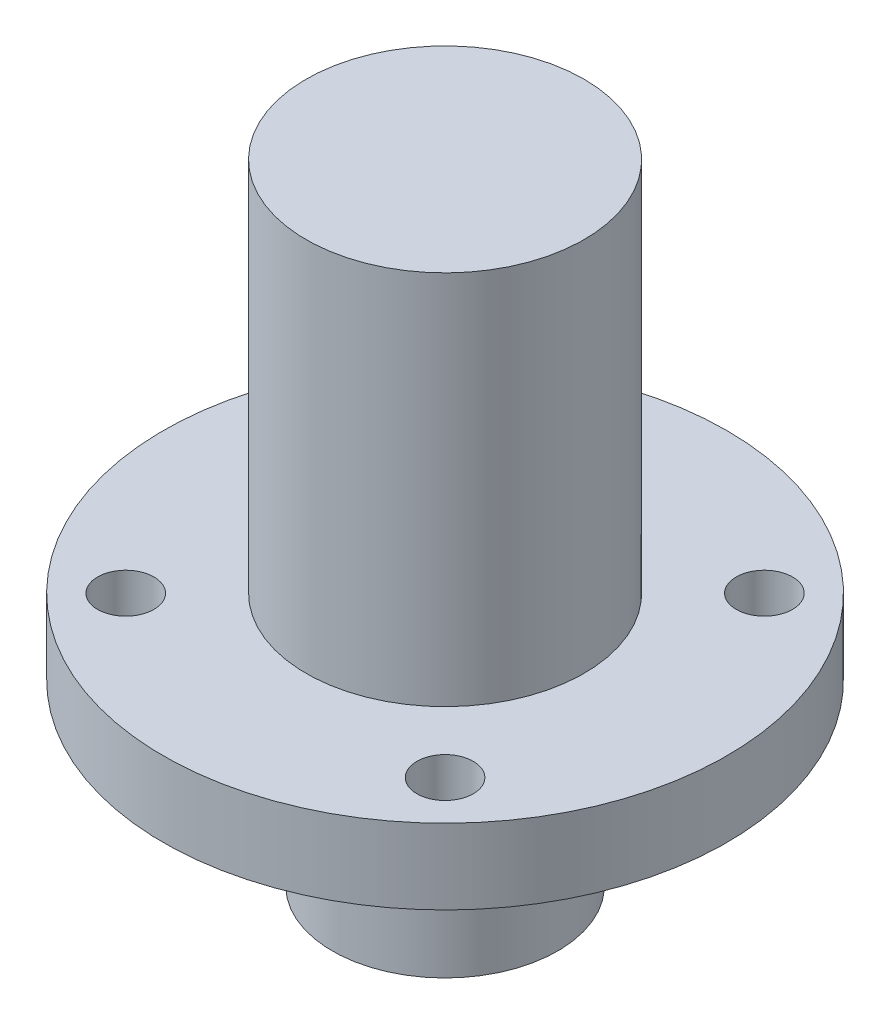
ISO-10303-21;
HEADER;
FILE_DESCRIPTION(('STEP AP214'),'2;1');
FILE_NAME('part.step','',(''),(''),'','','');
FILE_SCHEMA(('AUTOMOTIVE_DESIGN { 1 0 10303 214 1 1 1 1 }'));
ENDSEC;
DATA;
#1=APPLICATION_CONTEXT('core data for automotive mechanical design processes');
#2=APPLICATION_PROTOCOL_DEFINITION('international standard','automotive_design',2000,#1);
#3=PRODUCT_CONTEXT('',#1,'mechanical');
#4=PRODUCT('Part','Part','',(#3));
#5=PRODUCT_RELATED_PRODUCT_CATEGORY('part','',(#4));
#6=PRODUCT_DEFINITION_FORMATION('','',#4);
#7=PRODUCT_DEFINITION_CONTEXT('part definition',#1,'design');
#8=PRODUCT_DEFINITION('design','',#6,#7);
#9=PRODUCT_DEFINITION_SHAPE('','',#8);
#10=(LENGTH_UNIT() NAMED_UNIT(*) SI_UNIT(.MILLI.,.METRE.));
#11=(NAMED_UNIT(*) PLANE_ANGLE_UNIT() SI_UNIT($,.RADIAN.));
#12=(NAMED_UNIT(*) SI_UNIT($,.STERADIAN.) SOLID_ANGLE_UNIT());
#13=UNCERTAINTY_MEASURE_WITH_UNIT(LENGTH_MEASURE(1.E-05),#10,'distance_accuracy_value','');
#14=(GEOMETRIC_REPRESENTATION_CONTEXT(3) GLOBAL_UNCERTAINTY_ASSIGNED_CONTEXT((#13)) GLOBAL_UNIT_ASSIGNED_CONTEXT((#10,
#11,#12)) REPRESENTATION_CONTEXT('',''));
#15=CARTESIAN_POINT('',(0.,0.,0.));
#16=DIRECTION('',(0.,0.,1.));
#17=DIRECTION('',(1.,0.,0.));
#18=AXIS2_PLACEMENT_3D('',#15,#16,#17);
#19=CARTESIAN_POINT('',(0.,0.,0.));
#20=DIRECTION('',(0.,1.,0.));
#21=DIRECTION('',(0.,0.,1.));
#22=AXIS2_PLACEMENT_3D('',#19,#20,#21);
#23=PLANE('',#22);
#24=CARTESIAN_POINT('',(0.,0.,0.));
#25=DIRECTION('',(0.,1.,0.));
#26=DIRECTION('',(0.,0.,1.));
#27=AXIS2_PLACEMENT_3D('',#24,#25,#26);
#28=CIRCLE('',#27,3.);
#29=CARTESIAN_POINT('',(0.,0.,3.));
#30=VERTEX_POINT('',#29);
#31=EDGE_CURVE('E18',#30,#30,#28,.F.);
#32=ORIENTED_EDGE('',*,*,#31,.T.);
#33=EDGE_LOOP('',(#32));
#34=FACE_BOUND('',#33,.T.);
#35=ADVANCED_FACE('F15',(#34),#23,.F.);
#36=CARTESIAN_POINT('',(0.,-13.5,0.));
#37=DIRECTION('',(0.,1.,0.));
#38=DIRECTION('',(0.,0.,1.));
#39=AXIS2_PLACEMENT_3D('',#36,#37,#38);
#40=CYLINDRICAL_SURFACE('',#39,3.);
#41=CARTESIAN_POINT('',(0.,-13.5,0.));
#42=DIRECTION('',(0.,1.,0.));
#43=DIRECTION('',(0.,0.,1.));
#44=AXIS2_PLACEMENT_3D('',#41,#42,#43);
#45=CIRCLE('',#44,3.);
#46=CARTESIAN_POINT('',(0.,-13.5,3.00000000000001));
#47=VERTEX_POINT('',#46);
#48=EDGE_CURVE('E231',#47,#47,#45,.F.);
#49=ORIENTED_EDGE('',*,*,#48,.T.);
#50=EDGE_LOOP('',(#49));
#51=FACE_BOUND('',#50,.T.);
#52=ORIENTED_EDGE('',*,*,#31,.F.);
#53=EDGE_LOOP('',(#52));
#54=FACE_BOUND('',#53,.T.);
#55=CARTESIAN_POINT('',(0.,-7.875,3.00000000000001));
#56=CARTESIAN_POINT('',(-0.0557681985187935,-7.87500315639322,2.99999771774198));
#57=CARTESIAN_POINT('',(-0.111592826024643,-7.87957270352456,2.99842813446581));
#58=CARTESIAN_POINT('',(-0.221651603388951,-7.89769444796325,2.9923103999241));
#59=CARTESIAN_POINT('',(-0.275882995246631,-7.91126136185447,2.98775736891462));
#60=CARTESIAN_POINT('',(-0.381064108690752,-7.94685282185869,2.97616923326795));
#61=CARTESIAN_POINT('',(-0.432021235043022,-7.9688574391952,2.96913998030726));
#62=CARTESIAN_POINT('',(-0.529502310394442,-8.02062537747109,2.95331495585036));
#63=CARTESIAN_POINT('',(-0.576026738263901,-8.05038785901734,2.94451937549263));
#64=CARTESIAN_POINT('',(-0.665032275740394,-8.11796397160462,2.92572548917806));
#65=CARTESIAN_POINT('',(-0.707331121420944,-8.15600930824795,2.91569723263784));
#66=CARTESIAN_POINT('',(-0.785090323506352,-8.23858034903304,2.89572929041068));
#67=CARTESIAN_POINT('',(-0.820548717152932,-8.28310790673287,2.88578963092323));
#68=CARTESIAN_POINT('',(-0.884675707013827,-8.3790377221472,2.86679334128091));
#69=CARTESIAN_POINT('',(-0.913104598672638,-8.43060806474581,2.85777282843763));
#70=CARTESIAN_POINT('',(-0.960807381799251,-8.53815557218786,2.842091546309));
#71=CARTESIAN_POINT('',(-0.980084266063646,-8.5941312894404,2.83543000579777));
#72=CARTESIAN_POINT('',(-1.00824803630976,-8.70683062889315,2.82553588146698));
#73=CARTESIAN_POINT('',(-1.01747641885596,-8.76345874846577,2.82219096584632));
#74=CARTESIAN_POINT('',(-1.02634892814108,-8.87755083519966,2.81897717112307));
#75=CARTESIAN_POINT('',(-1.02599619712845,-8.93501452214662,2.81910715238348));
#76=CARTESIAN_POINT('',(-1.01598088679388,-9.04619530743339,2.8227303144107));
#77=CARTESIAN_POINT('',(-1.00676909065796,-9.09995925258925,2.82606064296596));
#78=CARTESIAN_POINT('',(-0.980034319750464,-9.20512708523259,2.83544200336763));
#79=CARTESIAN_POINT('',(-0.962510265290577,-9.25653066517802,2.84149338864977));
#80=CARTESIAN_POINT('',(-0.91936227021981,-9.35652321249325,2.85574768071261));
#81=CARTESIAN_POINT('',(-0.89360783894118,-9.40505077363136,2.86398485872874));
#82=CARTESIAN_POINT('',(-0.834822148521471,-9.49723311869947,2.8816682615302));
#83=CARTESIAN_POINT('',(-0.801789081052106,-9.54088668765085,2.89111478652488));
#84=CARTESIAN_POINT('',(-0.727244000371622,-9.62460470054454,2.91078677867293));
#85=CARTESIAN_POINT('',(-0.68536614306611,-9.6643406812821,2.92102654251258));
#86=CARTESIAN_POINT('',(-0.595399732886536,-9.73632754507554,2.94068300072235));
#87=CARTESIAN_POINT('',(-0.547308452374756,-9.7685751232936,2.95009933054987));
#88=CARTESIAN_POINT('',(-0.445542723212908,-9.82495408056372,2.96718441032709));
#89=CARTESIAN_POINT('',(-0.391810123570138,-9.84898725527921,2.97483168401103));
#90=CARTESIAN_POINT('',(-0.280797281645058,-9.88753006308091,2.98734907044193));
#91=CARTESIAN_POINT('',(-0.223524548981399,-9.90205914629182,2.99222485234876));
#92=CARTESIAN_POINT('',(-0.138097332351485,-9.91603312806549,2.99694583737048));
#93=CARTESIAN_POINT('',(-0.110602454311793,-9.91939138097834,2.99808762097649));
#94=CARTESIAN_POINT('',(-0.0554096955060137,-9.92387560258352,2.99961526980968));
#95=CARTESIAN_POINT('',(-0.027711814482597,-9.92500156844565,3.00000113407847));
#96=CARTESIAN_POINT('',(0.055768198518768,-9.92499684360696,2.99999771774204));
#97=CARTESIAN_POINT('',(0.111592826024614,-9.92042729647549,2.99842813446583));
#98=CARTESIAN_POINT('',(0.221651603388929,-9.90230555203671,2.99231039992409));
#99=CARTESIAN_POINT('',(0.275882995246621,-9.88873863814552,2.98775736891462));
#100=CARTESIAN_POINT('',(0.381064108690756,-9.85314717814132,2.97616923326796));
#101=CARTESIAN_POINT('',(0.432021235043028,-9.8311425608048,2.96913998030726));
#102=CARTESIAN_POINT('',(0.529502310394447,-9.77937462252891,2.95331495585036));
#103=CARTESIAN_POINT('',(0.576026738263903,-9.74961214098265,2.94451937549264));
#104=CARTESIAN_POINT('',(0.665032275740392,-9.68203602839538,2.92572548917806));
#105=CARTESIAN_POINT('',(0.707331121420941,-9.64399069175205,2.91569723263785));
#106=CARTESIAN_POINT('',(0.785090323506349,-9.56141965096696,2.89572929041068));
#107=CARTESIAN_POINT('',(0.82054871715293,-9.51689209326713,2.88578963092323));
#108=CARTESIAN_POINT('',(0.884675707013827,-9.4209622778528,2.86679334128091));
#109=CARTESIAN_POINT('',(0.913104598672638,-9.36939193525419,2.85777282843764));
#110=CARTESIAN_POINT('',(0.96080738179925,-9.26184442781214,2.842091546309));
#111=CARTESIAN_POINT('',(0.980084266063645,-9.20586871055959,2.83543000579778));
#112=CARTESIAN_POINT('',(1.00824803630976,-9.09316937110685,2.82553588146698));
#113=CARTESIAN_POINT('',(1.01747641885596,-9.03654125153423,2.82219096584633));
#114=CARTESIAN_POINT('',(1.02634892814108,-8.92244916480034,2.81897717112307));
#115=CARTESIAN_POINT('',(1.02599619712844,-8.86498547785338,2.81910715238348));
#116=CARTESIAN_POINT('',(1.01598088679388,-8.75380469256661,2.8227303144107));
#117=CARTESIAN_POINT('',(1.00676909065795,-8.70004074741074,2.82606064296596));
#118=CARTESIAN_POINT('',(0.980034319750462,-8.59487291476741,2.83544200336764));
#119=CARTESIAN_POINT('',(0.962510265290575,-8.54346933482198,2.84149338864977));
#120=CARTESIAN_POINT('',(0.919362270219808,-8.44347678750675,2.85574768071262));
#121=CARTESIAN_POINT('',(0.893607838941177,-8.39494922636864,2.86398485872874));
#122=CARTESIAN_POINT('',(0.834822148521467,-8.30276688130053,2.8816682615302));
#123=CARTESIAN_POINT('',(0.801789081052103,-8.25911331234914,2.89111478652488));
#124=CARTESIAN_POINT('',(0.727244000371619,-8.17539529945546,2.91078677867293));
#125=CARTESIAN_POINT('',(0.685366143066109,-8.1356593187179,2.92102654251258));
#126=CARTESIAN_POINT('',(0.595399732886535,-8.06367245492446,2.94068300072235));
#127=CARTESIAN_POINT('',(0.547308452374754,-8.0314248767064,2.95009933054987));
#128=CARTESIAN_POINT('',(0.445542723212901,-7.97504591943628,2.96718441032709));
#129=CARTESIAN_POINT('',(0.391810123570127,-7.95101274472078,2.97483168401103));
#130=CARTESIAN_POINT('',(0.280797281645047,-7.91246993691909,2.98734907044193));
#131=CARTESIAN_POINT('',(0.223524548981392,-7.89794085370819,2.99222485234875));
#132=CARTESIAN_POINT('',(0.138097332351482,-7.8839668719345,2.99694583737048));
#133=CARTESIAN_POINT('',(0.110602454311789,-7.88060861902163,2.9980876209765));
#134=CARTESIAN_POINT('',(0.0554096955060035,-7.87612439741651,2.99961526980967));
#135=CARTESIAN_POINT('',(0.0277118144825811,-7.87499843155444,3.00000113407844));
#136=CARTESIAN_POINT('',(0.,-7.875,3.00000000000001));
#137=B_SPLINE_CURVE_WITH_KNOTS('',3,(#55,#56,#57,#58,#59,#60,#61,#62,#63,#64,#65,#66,#67,#68,
#69,#70,#71,#72,#73,#74,#75,#76,#77,#78,#79,#80,#81,#82,#83,#84,#85,#86,#87,#88,#89,#90,#91,#92,
#93,#94,#95,#96,#97,#98,#99,#100,#101,#102,#103,#104,#105,#106,#107,#108,#109,#110,#111,#112,
#113,#114,#115,#116,#117,#118,#119,#120,#121,#122,#123,#124,#125,#126,#127,#128,#129,#130,#131,
#132,#133,#134,#135,#136),.UNSPECIFIED.,.T.,.F.,(4,2,2,2,2,2,2,2,2,2,2,2,2,2,2,2,2,2,2,2,2,2,2,
2,2,2,2,2,2,2,2,2,2,2,2,2,2,2,2,2,4),(0.,0.167197591782786,0.334669337795041,0.501747949369005,
0.668808490703694,0.841338966433507,1.0139188736308,1.19175534529934,1.36953362256539,
1.54106092431714,1.71253197218093,1.87571556166074,2.03892035304202,2.20485305034404,
2.37082701908602,2.54590994772049,2.72106999903256,2.8982563179868,3.07507888115531,
3.15816104794856,3.2412433200764,3.40844091185919,3.57591265787148,3.74299126944545,
3.91005181078013,4.08258228650994,4.25516219370724,4.43299866537578,4.61077694264183,
4.78230424439357,4.95377529225736,5.11695888173717,5.28016367311846,5.44609637042047,
5.61207033916246,5.78715326779692,5.962313319109,6.13949963806325,6.31632220123174,
6.39940436802499,6.48248664015285),.UNSPECIFIED.);
#138=CARTESIAN_POINT('',(0.,-7.875,3.00000000000001));
#139=VERTEX_POINT('',#138);
#140=EDGE_CURVE('E233',#139,#139,#137,.T.);
#141=ORIENTED_EDGE('',*,*,#140,.T.);
#142=EDGE_LOOP('',(#141));
#143=FACE_BOUND('',#142,.T.);
#144=ADVANCED_FACE('F180',(#51,#54,#143),#40,.F.);
#145=CARTESIAN_POINT('',(0.,-13.5,0.));
#146=DIRECTION('',(0.,1.,0.));
#147=DIRECTION('',(0.,0.,1.));
#148=AXIS2_PLACEMENT_3D('',#145,#146,#147);
#149=PLANE('',#148);
#150=ORIENTED_EDGE('',*,*,#48,.F.);
#151=EDGE_LOOP('',(#150));
#152=FACE_BOUND('',#151,.T.);
#153=CARTESIAN_POINT('',(0.,-13.5,0.));
#154=DIRECTION('',(0.,-1.,0.));
#155=DIRECTION('',(0.,0.,-1.));
#156=AXIS2_PLACEMENT_3D('',#153,#154,#155);
#157=CIRCLE('',#156,6.);
#158=CARTESIAN_POINT('',(0.,-13.5,-5.99999999999999));
#159=VERTEX_POINT('',#158);
#160=EDGE_CURVE('E70',#159,#159,#157,.F.);
#161=ORIENTED_EDGE('',*,*,#160,.F.);
#162=EDGE_LOOP('',(#161));
#163=FACE_BOUND('',#162,.T.);
#164=ADVANCED_FACE('F173',(#152,#163),#149,.F.);
#165=CARTESIAN_POINT('',(0.,-8.9,0.));
#166=DIRECTION('',(0.,0.,1.));
#167=DIRECTION('',(1.,0.,0.));
#168=AXIS2_PLACEMENT_3D('',#165,#166,#167);
#169=CYLINDRICAL_SURFACE('',#168,1.025);
#170=CARTESIAN_POINT('',(0.,-9.925,6.00000000000001));
#171=CARTESIAN_POINT('',(-0.0570727036526101,-9.9249973582478,5.99999888367396));
#172=CARTESIAN_POINT('',(-0.114217995291063,-9.92021299881119,5.99917649145897));
#173=CARTESIAN_POINT('',(-0.226947602401946,-9.90119890142921,5.99597278168219));
#174=CARTESIAN_POINT('',(-0.282528520665261,-9.88695004621472,5.99358830901916));
#175=CARTESIAN_POINT('',(-0.390417951477671,-9.8494494621417,5.98752779303888));
#176=CARTESIAN_POINT('',(-0.442730505593949,-9.82620911850284,5.98385338361059));
#177=CARTESIAN_POINT('',(-0.542692117283802,-9.77141215801521,5.97561743459344));
#178=CARTESIAN_POINT('',(-0.5903428811297,-9.73985859963918,5.97105622142544));
#179=CARTESIAN_POINT('',(-0.680134678509648,-9.66898789111447,5.96149953964205));
#180=CARTESIAN_POINT('',(-0.722221772129054,-9.62960286828461,5.95650050498387));
#181=CARTESIAN_POINT('',(-0.799226339431641,-9.54433149838725,5.94665855670755));
#182=CARTESIAN_POINT('',(-0.834142977213231,-9.49844439438704,5.94181566134689));
#183=CARTESIAN_POINT('',(-0.896027458481573,-9.40110569336642,5.93280055773456));
#184=CARTESIAN_POINT('',(-0.922942448182577,-9.34962003658294,5.92863288836528));
#185=CARTESIAN_POINT('',(-0.967721214157244,-9.2427756448839,5.92148909073923));
#186=CARTESIAN_POINT('',(-0.985585711820137,-9.18741721905628,5.91851286751961));
#187=CARTESIAN_POINT('',(-1.01158815815292,-9.07496449242363,5.91412405394062));
#188=CARTESIAN_POINT('',(-1.01981833166631,-9.01789210606765,5.91269664730548));
#189=CARTESIAN_POINT('',(-1.02660450284924,-8.90315987633103,5.9115222948616));
#190=CARTESIAN_POINT('',(-1.02516120394753,-8.84550007597,5.91177522686318));
#191=CARTESIAN_POINT('',(-1.01271648200547,-8.73189059075329,5.91391944934594));
#192=CARTESIAN_POINT('',(-1.00181898478487,-8.67592913659646,5.91579292524544));
#193=CARTESIAN_POINT('',(-0.970938254331942,-8.56664026185383,5.92093926230969));
#194=CARTESIAN_POINT('',(-0.950954621256657,-8.51331295730047,5.92421218505789));
#195=CARTESIAN_POINT('',(-0.902363485934302,-8.41049523788171,5.93180788822082));
#196=CARTESIAN_POINT('',(-0.87371278086127,-8.3610256434342,5.93613590649742));
#197=CARTESIAN_POINT('',(-0.808633787476838,-8.26756067045512,5.94535011285503));
#198=CARTESIAN_POINT('',(-0.772205437461036,-8.22356533535829,5.95023630536419));
#199=CARTESIAN_POINT('',(-0.692047288877386,-8.14169967602171,5.96009383827313));
#200=CARTESIAN_POINT('',(-0.648229691177216,-8.10391531214324,5.96506546606228));
#201=CARTESIAN_POINT('',(-0.554808086968543,-8.03620514278666,5.97447808051634));
#202=CARTESIAN_POINT('',(-0.505201511585977,-8.00628284541836,5.97891882981946));
#203=CARTESIAN_POINT('',(-0.401514356395531,-7.95513989173958,5.98677656749847));
#204=CARTESIAN_POINT('',(-0.34742628082666,-7.93393418282629,5.99019179460691));
#205=CARTESIAN_POINT('',(-0.236455850980942,-7.90097505688313,5.99559485949407));
#206=CARTESIAN_POINT('',(-0.179579655006954,-7.88920172312246,5.99758570394111));
#207=CARTESIAN_POINT('',(-0.101907672807836,-7.87987325795215,5.99916915421192));
#208=CARTESIAN_POINT('',(-0.0815729093342666,-7.8780472691695,5.99948005321213));
#209=CARTESIAN_POINT('',(-0.0408285276930975,-7.87561016708081,5.99989567589232));
#210=CARTESIAN_POINT('',(-0.020418909458652,-7.87499905485993,6.00000039938814));
#211=CARTESIAN_POINT('',(0.057072703652595,-7.87500264175219,5.99999888367396));
#212=CARTESIAN_POINT('',(0.114217995291048,-7.87978700118881,5.99917649145897));
#213=CARTESIAN_POINT('',(0.226947602401931,-7.89880109857079,5.99597278168219));
#214=CARTESIAN_POINT('',(0.282528520665247,-7.91304995378528,5.99358830901916));
#215=CARTESIAN_POINT('',(0.390417951477657,-7.9505505378583,5.98752779303888));
#216=CARTESIAN_POINT('',(0.442730505593935,-7.97379088149716,5.98385338361059));
#217=CARTESIAN_POINT('',(0.542692117283789,-8.02858784198478,5.97561743459344));
#218=CARTESIAN_POINT('',(0.590342881129687,-8.06014140036081,5.97105622142544));
#219=CARTESIAN_POINT('',(0.680134678509635,-8.13101210888552,5.96149953964205));
#220=CARTESIAN_POINT('',(0.722221772129042,-8.17039713171538,5.95650050498387));
#221=CARTESIAN_POINT('',(0.799226339431631,-8.25566850161274,5.94665855670755));
#222=CARTESIAN_POINT('',(0.834142977213221,-8.30155560561295,5.9418156613469));
#223=CARTESIAN_POINT('',(0.896027458481564,-8.39889430663357,5.93280055773456));
#224=CARTESIAN_POINT('',(0.922942448182569,-8.45037996341705,5.92863288836528));
#225=CARTESIAN_POINT('',(0.967721214157237,-8.55722435511609,5.92148909073923));
#226=CARTESIAN_POINT('',(0.98558571182013,-8.61258278094371,5.91851286751961));
#227=CARTESIAN_POINT('',(1.01158815815291,-8.72503550757636,5.91412405394062));
#228=CARTESIAN_POINT('',(1.0198183316663,-8.78210789393233,5.91269664730548));
#229=CARTESIAN_POINT('',(1.02660450284924,-8.89684012366895,5.91152229486161));
#230=CARTESIAN_POINT('',(1.02516120394753,-8.95449992402999,5.91177522686318));
#231=CARTESIAN_POINT('',(1.01271648200547,-9.06810940924669,5.91391944934594));
#232=CARTESIAN_POINT('',(1.00181898478487,-9.12407086340352,5.91579292524544));
#233=CARTESIAN_POINT('',(0.970938254331942,-9.23335973814616,5.9209392623097));
#234=CARTESIAN_POINT('',(0.950954621256657,-9.28668704269952,5.92421218505789));
#235=CARTESIAN_POINT('',(0.902363485934303,-9.38950476211828,5.93180788822083));
#236=CARTESIAN_POINT('',(0.873712780861272,-9.43897435656579,5.93613590649743));
#237=CARTESIAN_POINT('',(0.808633787476842,-9.53243932954487,5.94535011285503));
#238=CARTESIAN_POINT('',(0.772205437461041,-9.5764346646417,5.95023630536419));
#239=CARTESIAN_POINT('',(0.692047288877391,-9.65830032397828,5.96009383827313));
#240=CARTESIAN_POINT('',(0.64822969117722,-9.69608468785675,5.96506546606229));
#241=CARTESIAN_POINT('',(0.554808086968546,-9.76379485721333,5.97447808051634));
#242=CARTESIAN_POINT('',(0.505201511585981,-9.79371715458163,5.97891882981947));
#243=CARTESIAN_POINT('',(0.401514356395537,-9.84486010826041,5.98677656749847));
#244=CARTESIAN_POINT('',(0.347426280826666,-9.86606581717371,5.99019179460692));
#245=CARTESIAN_POINT('',(0.236455850980949,-9.89902494311686,5.99559485949407));
#246=CARTESIAN_POINT('',(0.179579655006962,-9.91079827687754,5.99758570394111));
#247=CARTESIAN_POINT('',(0.10190767280784,-9.92012674204785,5.99916915421192));
#248=CARTESIAN_POINT('',(0.081572909334267,-9.9219527308305,5.99948005321213));
#249=CARTESIAN_POINT('',(0.0408285276930901,-9.92438983291919,5.99989567589233));
#250=CARTESIAN_POINT('',(0.0204189094586409,-9.92500094514007,6.00000039938814));
#251=CARTESIAN_POINT('',(0.,-9.925,6.00000000000001));
#252=B_SPLINE_CURVE_WITH_KNOTS('',3,(#170,#171,#172,#173,#174,#175,#176,#177,#178,#179,#180,
#181,#182,#183,#184,#185,#186,#187,#188,#189,#190,#191,#192,#193,#194,#195,#196,#197,#198,#199,
#200,#201,#202,#203,#204,#205,#206,#207,#208,#209,#210,#211,#212,#213,#214,#215,#216,#217,#218,
#219,#220,#221,#222,#223,#224,#225,#226,#227,#228,#229,#230,#231,#232,#233,#234,#235,#236,#237,
#238,#239,#240,#241,#242,#243,#244,#245,#246,#247,#248,#249,#250,#251),.UNSPECIFIED.,.T.,.F.,(4,
2,2,2,2,2,2,2,2,2,2,2,2,2,2,2,2,2,2,2,2,2,2,2,2,2,2,2,2,2,2,2,2,2,2,2,2,2,2,2,4),(0.,
0.171140157064411,0.342627054445388,0.513897518291094,0.685105058665002,0.85786670505377,
1.03064847985041,1.20454740085766,1.37843245869008,1.55063902097633,1.72283306100317,
1.89315789312309,2.06349022125438,2.2346860025451,2.40588314207803,2.57927991361465,
2.75275392512924,2.92652418499491,3.09992654971796,3.16115533382726,3.22238417262745,
3.39352432969186,3.56501122707284,3.73628169091854,3.90748923129245,4.08025087768122,
4.25303265247786,4.42693157348511,4.60081663131752,4.77302319360378,4.94521723363061,
5.11554206575053,5.28587439388183,5.45707017517255,5.62826731470547,5.8016640862421,
5.97513809775669,6.14890835762236,6.32231072234541,6.38353950645472,6.44476834525492),.UNSPECIFIED.);
#253=CARTESIAN_POINT('',(0.,-9.925,6.00000000000001));
#254=VERTEX_POINT('',#253);
#255=EDGE_CURVE('E62',#254,#254,#252,.T.);
#256=ORIENTED_EDGE('',*,*,#255,.F.);
#257=EDGE_LOOP('',(#256));
#258=FACE_BOUND('',#257,.T.);
#259=ORIENTED_EDGE('',*,*,#140,.F.);
#260=EDGE_LOOP('',(#259));
#261=FACE_BOUND('',#260,.T.);
#262=ADVANCED_FACE('F72',(#258,#261),#169,.F.);
#263=CARTESIAN_POINT('',(0.,-4.,0.));
#264=DIRECTION('',(0.,-1.,0.));
#265=DIRECTION('',(0.,0.,-1.));
#266=AXIS2_PLACEMENT_3D('',#263,#264,#265);
#267=CYLINDRICAL_SURFACE('',#266,6.);
#268=ORIENTED_EDGE('',*,*,#160,.T.);
#269=EDGE_LOOP('',(#268));
#270=FACE_BOUND('',#269,.T.);
#271=CARTESIAN_POINT('',(0.,-4.00000000000001,0.));
#272=DIRECTION('',(0.,-1.,0.));
#273=DIRECTION('',(0.,0.,-1.));
#274=AXIS2_PLACEMENT_3D('',#271,#272,#273);
#275=CIRCLE('',#274,6.);
#276=CARTESIAN_POINT('',(0.,-4.00000000000001,-6.));
#277=VERTEX_POINT('',#276);
#278=EDGE_CURVE('E59',#277,#277,#275,.T.);
#279=ORIENTED_EDGE('',*,*,#278,.T.);
#280=EDGE_LOOP('',(#279));
#281=FACE_BOUND('',#280,.T.);
#282=ORIENTED_EDGE('',*,*,#255,.T.);
#283=EDGE_LOOP('',(#282));
#284=FACE_BOUND('',#283,.T.);
#285=ADVANCED_FACE('F75',(#270,#281,#284),#267,.T.);
#286=CARTESIAN_POINT('',(0.,-4.,0.));
#287=DIRECTION('',(0.,1.,0.));
#288=DIRECTION('',(0.,0.,1.));
#289=AXIS2_PLACEMENT_3D('',#286,#287,#288);
#290=PLANE('',#289);
#291=CARTESIAN_POINT('',(8.5,-4.,8.5));
#292=DIRECTION('',(0.,1.,0.));
#293=DIRECTION('',(0.,0.,1.));
#294=AXIS2_PLACEMENT_3D('',#291,#292,#293);
#295=CIRCLE('',#294,1.5);
#296=CARTESIAN_POINT('',(8.5,-4.,10.));
#297=VERTEX_POINT('',#296);
#298=EDGE_CURVE('E47',#297,#297,#295,.T.);
#299=ORIENTED_EDGE('',*,*,#298,.T.);
#300=EDGE_LOOP('',(#299));
#301=FACE_BOUND('',#300,.T.);
#302=ORIENTED_EDGE('',*,*,#278,.F.);
#303=EDGE_LOOP('',(#302));
#304=FACE_BOUND('',#303,.T.);
#305=CARTESIAN_POINT('',(8.5,-4.,-8.5));
#306=DIRECTION('',(0.,1.,0.));
#307=DIRECTION('',(0.,0.,1.));
#308=AXIS2_PLACEMENT_3D('',#305,#306,#307);
#309=CIRCLE('',#308,1.5);
#310=CARTESIAN_POINT('',(8.5,-4.,-7.));
#311=VERTEX_POINT('',#310);
#312=EDGE_CURVE('E44',#311,#311,#309,.T.);
#313=ORIENTED_EDGE('',*,*,#312,.T.);
#314=EDGE_LOOP('',(#313));
#315=FACE_BOUND('',#314,.T.);
#316=CARTESIAN_POINT('',(-8.5,-4.,8.5));
#317=DIRECTION('',(0.,1.,0.));
#318=DIRECTION('',(0.,0.,1.));
#319=AXIS2_PLACEMENT_3D('',#316,#317,#318);
#320=CIRCLE('',#319,1.5);
#321=CARTESIAN_POINT('',(-8.5,-4.,10.));
#322=VERTEX_POINT('',#321);
#323=EDGE_CURVE('E53',#322,#322,#320,.T.);
#324=ORIENTED_EDGE('',*,*,#323,.T.);
#325=EDGE_LOOP('',(#324));
#326=FACE_BOUND('',#325,.T.);
#327=CARTESIAN_POINT('',(-8.5,-4.,-8.5));
#328=DIRECTION('',(0.,1.,0.));
#329=DIRECTION('',(0.,0.,1.));
#330=AXIS2_PLACEMENT_3D('',#327,#328,#329);
#331=CIRCLE('',#330,1.5);
#332=CARTESIAN_POINT('',(-8.5,-4.,-7.));
#333=VERTEX_POINT('',#332);
#334=EDGE_CURVE('E50',#333,#333,#331,.T.);
#335=ORIENTED_EDGE('',*,*,#334,.T.);
#336=EDGE_LOOP('',(#335));
#337=FACE_BOUND('',#336,.T.);
#338=CARTESIAN_POINT('',(0.,-4.00000000000001,0.));
#339=DIRECTION('',(0.,-1.,0.));
#340=DIRECTION('',(0.,0.,-1.));
#341=AXIS2_PLACEMENT_3D('',#338,#339,#340);
#342=CIRCLE('',#341,15.);
#343=CARTESIAN_POINT('',(0.,-4.00000000000003,-15.));
#344=VERTEX_POINT('',#343);
#345=EDGE_CURVE('E56',#344,#344,#342,.F.);
#346=ORIENTED_EDGE('',*,*,#345,.F.);
#347=EDGE_LOOP('',(#346));
#348=FACE_BOUND('',#347,.T.);
#349=ADVANCED_FACE('F79',(#301,#304,#315,#326,#337,#348),#290,.F.);
#350=CARTESIAN_POINT('',(0.,0.,0.));
#351=DIRECTION('',(0.,-1.,0.));
#352=DIRECTION('',(0.,0.,-1.));
#353=AXIS2_PLACEMENT_3D('',#350,#351,#352);
#354=CYLINDRICAL_SURFACE('',#353,15.);
#355=ORIENTED_EDGE('',*,*,#345,.T.);
#356=EDGE_LOOP('',(#355));
#357=FACE_BOUND('',#356,.T.);
#358=CARTESIAN_POINT('',(0.,0.,0.));
#359=DIRECTION('',(0.,-1.,0.));
#360=DIRECTION('',(0.,0.,-1.));
#361=AXIS2_PLACEMENT_3D('',#358,#359,#360);
#362=CIRCLE('',#361,15.);
#363=CARTESIAN_POINT('',(0.,0.,-15.));
#364=VERTEX_POINT('',#363);
#365=EDGE_CURVE('E41',#364,#364,#362,.T.);
#366=ORIENTED_EDGE('',*,*,#365,.T.);
#367=EDGE_LOOP('',(#366));
#368=FACE_BOUND('',#367,.T.);
#369=ADVANCED_FACE('F83',(#357,#368),#354,.T.);
#370=CARTESIAN_POINT('',(-8.5,0.,8.5));
#371=DIRECTION('',(0.,1.,0.));
#372=DIRECTION('',(0.,0.,1.));
#373=AXIS2_PLACEMENT_3D('',#370,#371,#372);
#374=CYLINDRICAL_SURFACE('',#373,1.5);
#375=ORIENTED_EDGE('',*,*,#323,.F.);
#376=EDGE_LOOP('',(#375));
#377=FACE_BOUND('',#376,.T.);
#378=CARTESIAN_POINT('',(-8.5,0.,8.5));
#379=DIRECTION('',(0.,1.,0.));
#380=DIRECTION('',(0.,0.,1.));
#381=AXIS2_PLACEMENT_3D('',#378,#379,#380);
#382=CIRCLE('',#381,1.5);
#383=CARTESIAN_POINT('',(-8.5,0.,10.));
#384=VERTEX_POINT('',#383);
#385=EDGE_CURVE('E38',#384,#384,#382,.T.);
#386=ORIENTED_EDGE('',*,*,#385,.T.);
#387=EDGE_LOOP('',(#386));
#388=FACE_BOUND('',#387,.T.);
#389=ADVANCED_FACE('F87',(#377,#388),#374,.F.);
#390=CARTESIAN_POINT('',(-8.5,0.,-8.5));
#391=DIRECTION('',(0.,1.,0.));
#392=DIRECTION('',(0.,0.,1.));
#393=AXIS2_PLACEMENT_3D('',#390,#391,#392);
#394=CYLINDRICAL_SURFACE('',#393,1.5);
#395=ORIENTED_EDGE('',*,*,#334,.F.);
#396=EDGE_LOOP('',(#395));
#397=FACE_BOUND('',#396,.T.);
#398=CARTESIAN_POINT('',(-8.5,0.,-8.5));
#399=DIRECTION('',(0.,1.,0.));
#400=DIRECTION('',(0.,0.,1.));
#401=AXIS2_PLACEMENT_3D('',#398,#399,#400);
#402=CIRCLE('',#401,1.5);
#403=CARTESIAN_POINT('',(-8.5,0.,-7.));
#404=VERTEX_POINT('',#403);
#405=EDGE_CURVE('E35',#404,#404,#402,.T.);
#406=ORIENTED_EDGE('',*,*,#405,.T.);
#407=EDGE_LOOP('',(#406));
#408=FACE_BOUND('',#407,.T.);
#409=ADVANCED_FACE('F91',(#397,#408),#394,.F.);
#410=CARTESIAN_POINT('',(8.5,0.,8.5));
#411=DIRECTION('',(0.,1.,0.));
#412=DIRECTION('',(0.,0.,1.));
#413=AXIS2_PLACEMENT_3D('',#410,#411,#412);
#414=CYLINDRICAL_SURFACE('',#413,1.5);
#415=ORIENTED_EDGE('',*,*,#298,.F.);
#416=EDGE_LOOP('',(#415));
#417=FACE_BOUND('',#416,.T.);
#418=CARTESIAN_POINT('',(8.5,0.,8.5));
#419=DIRECTION('',(0.,1.,0.));
#420=DIRECTION('',(0.,0.,1.));
#421=AXIS2_PLACEMENT_3D('',#418,#419,#420);
#422=CIRCLE('',#421,1.5);
#423=CARTESIAN_POINT('',(8.5,0.,10.));
#424=VERTEX_POINT('',#423);
#425=EDGE_CURVE('E32',#424,#424,#422,.T.);
#426=ORIENTED_EDGE('',*,*,#425,.T.);
#427=EDGE_LOOP('',(#426));
#428=FACE_BOUND('',#427,.T.);
#429=ADVANCED_FACE('F95',(#417,#428),#414,.F.);
#430=CARTESIAN_POINT('',(8.5,0.,-8.5));
#431=DIRECTION('',(0.,1.,0.));
#432=DIRECTION('',(0.,0.,1.));
#433=AXIS2_PLACEMENT_3D('',#430,#431,#432);
#434=CYLINDRICAL_SURFACE('',#433,1.5);
#435=ORIENTED_EDGE('',*,*,#312,.F.);
#436=EDGE_LOOP('',(#435));
#437=FACE_BOUND('',#436,.T.);
#438=CARTESIAN_POINT('',(8.5,0.,-8.5));
#439=DIRECTION('',(0.,1.,0.));
#440=DIRECTION('',(0.,0.,1.));
#441=AXIS2_PLACEMENT_3D('',#438,#439,#440);
#442=CIRCLE('',#441,1.5);
#443=CARTESIAN_POINT('',(8.5,0.,-7.));
#444=VERTEX_POINT('',#443);
#445=EDGE_CURVE('E27',#444,#444,#442,.T.);
#446=ORIENTED_EDGE('',*,*,#445,.T.);
#447=EDGE_LOOP('',(#446));
#448=FACE_BOUND('',#447,.T.);
#449=ADVANCED_FACE('F99',(#437,#448),#434,.F.);
#450=CARTESIAN_POINT('',(0.,0.,0.));
#451=DIRECTION('',(0.,-1.,0.));
#452=DIRECTION('',(0.,0.,-1.));
#453=AXIS2_PLACEMENT_3D('',#450,#451,#452);
#454=PLANE('',#453);
#455=ORIENTED_EDGE('',*,*,#445,.F.);
#456=EDGE_LOOP('',(#455));
#457=FACE_BOUND('',#456,.T.);
#458=ORIENTED_EDGE('',*,*,#425,.F.);
#459=EDGE_LOOP('',(#458));
#460=FACE_BOUND('',#459,.T.);
#461=CARTESIAN_POINT('',(0.,0.,0.));
#462=DIRECTION('',(0.,-1.,0.));
#463=DIRECTION('',(0.,0.,-1.));
#464=AXIS2_PLACEMENT_3D('',#461,#462,#463);
#465=CIRCLE('',#464,7.4);
#466=CARTESIAN_POINT('',(0.,0.,-7.4));
#467=VERTEX_POINT('',#466);
#468=EDGE_CURVE('E22',#467,#467,#465,.F.);
#469=ORIENTED_EDGE('',*,*,#468,.F.);
#470=EDGE_LOOP('',(#469));
#471=FACE_BOUND('',#470,.T.);
#472=ORIENTED_EDGE('',*,*,#405,.F.);
#473=EDGE_LOOP('',(#472));
#474=FACE_BOUND('',#473,.T.);
#475=ORIENTED_EDGE('',*,*,#385,.F.);
#476=EDGE_LOOP('',(#475));
#477=FACE_BOUND('',#476,.T.);
#478=ORIENTED_EDGE('',*,*,#365,.F.);
#479=EDGE_LOOP('',(#478));
#480=FACE_BOUND('',#479,.T.);
#481=ADVANCED_FACE('F103',(#457,#460,#471,#474,#477,#480),#454,.F.);
#482=CARTESIAN_POINT('',(0.,20.,0.));
#483=DIRECTION('',(0.,-1.,0.));
#484=DIRECTION('',(0.,0.,-1.));
#485=AXIS2_PLACEMENT_3D('',#482,#483,#484);
#486=PLANE('',#485);
#487=CARTESIAN_POINT('',(0.,20.,0.));
#488=DIRECTION('',(0.,-1.,0.));
#489=DIRECTION('',(0.,0.,-1.));
#490=AXIS2_PLACEMENT_3D('',#487,#488,#489);
#491=CIRCLE('',#490,7.4);
#492=CARTESIAN_POINT('',(0.,20.,-7.40000000000002));
#493=VERTEX_POINT('',#492);
#494=EDGE_CURVE('E10',#493,#493,#491,.T.);
#495=ORIENTED_EDGE('',*,*,#494,.F.);
#496=EDGE_LOOP('',(#495));
#497=FACE_BOUND('',#496,.T.);
#498=ADVANCED_FACE('F107',(#497),#486,.F.);
#499=CARTESIAN_POINT('',(0.,20.,0.));
#500=DIRECTION('',(0.,-1.,0.));
#501=DIRECTION('',(0.,0.,-1.));
#502=AXIS2_PLACEMENT_3D('',#499,#500,#501);
#503=CYLINDRICAL_SURFACE('',#502,7.4);
#504=ORIENTED_EDGE('',*,*,#468,.T.);
#505=EDGE_LOOP('',(#504));
#506=FACE_BOUND('',#505,.T.);
#507=ORIENTED_EDGE('',*,*,#494,.T.);
#508=EDGE_LOOP('',(#507));
#509=FACE_BOUND('',#508,.T.);
#510=ADVANCED_FACE('F111',(#506,#509),#503,.T.);
#511=CLOSED_SHELL('',(#35,#144,#164,#262,#285,#349,#369,#389,#409,#429,#449,#481,#498,#510));
#512=MANIFOLD_SOLID_BREP('B1',#511);
#513=ADVANCED_BREP_SHAPE_REPRESENTATION('',(#18,#512),#14);
#514=SHAPE_DEFINITION_REPRESENTATION(#9,#513);
ENDSEC;
END-ISO-10303-21;
